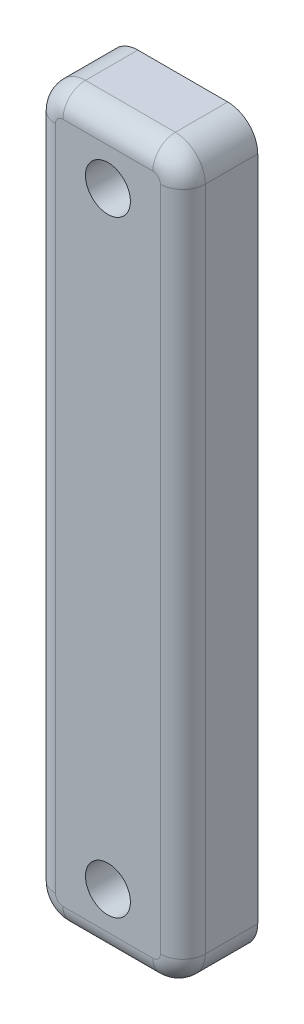
ISO-10303-21;
HEADER;
FILE_DESCRIPTION(('STEP AP214'),'2;1');
FILE_NAME('part.step','',(''),(''),'','','');
FILE_SCHEMA(('AUTOMOTIVE_DESIGN { 1 0 10303 214 1 1 1 1 }'));
ENDSEC;
DATA;
#1=APPLICATION_CONTEXT('core data for automotive mechanical design processes');
#2=APPLICATION_PROTOCOL_DEFINITION('international standard','automotive_design',2000,#1);
#3=PRODUCT_CONTEXT('',#1,'mechanical');
#4=PRODUCT('Part','Part','',(#3));
#5=PRODUCT_RELATED_PRODUCT_CATEGORY('part','',(#4));
#6=PRODUCT_DEFINITION_FORMATION('','',#4);
#7=PRODUCT_DEFINITION_CONTEXT('part definition',#1,'design');
#8=PRODUCT_DEFINITION('design','',#6,#7);
#9=PRODUCT_DEFINITION_SHAPE('','',#8);
#10=(LENGTH_UNIT() NAMED_UNIT(*) SI_UNIT(.MILLI.,.METRE.));
#11=(NAMED_UNIT(*) PLANE_ANGLE_UNIT() SI_UNIT($,.RADIAN.));
#12=(NAMED_UNIT(*) SI_UNIT($,.STERADIAN.) SOLID_ANGLE_UNIT());
#13=UNCERTAINTY_MEASURE_WITH_UNIT(LENGTH_MEASURE(1.E-05),#10,'distance_accuracy_value','');
#14=(GEOMETRIC_REPRESENTATION_CONTEXT(3) GLOBAL_UNCERTAINTY_ASSIGNED_CONTEXT((#13)) GLOBAL_UNIT_ASSIGNED_CONTEXT((#10,
#11,#12)) REPRESENTATION_CONTEXT('',''));
#15=CARTESIAN_POINT('',(0.,0.,0.));
#16=DIRECTION('',(0.,0.,1.));
#17=DIRECTION('',(1.,0.,0.));
#18=AXIS2_PLACEMENT_3D('',#15,#16,#17);
#19=CARTESIAN_POINT('',(8.,18.5841809112383,5.));
#20=DIRECTION('',(0.,0.,-1.));
#21=DIRECTION('',(-1.,0.,0.));
#22=AXIS2_PLACEMENT_3D('',#19,#20,#21);
#23=CYLINDRICAL_SURFACE('',#22,2.);
#24=DIRECTION('',(0.,0.,-1.));
#25=VECTOR('',#24,1.);
#26=CARTESIAN_POINT('',(7.99999999999998,20.5841809112383,5.));
#27=LINE('',#26,#25);
#28=CARTESIAN_POINT('',(7.99999999999998,20.5841809112383,3.5));
#29=VERTEX_POINT('',#28);
#30=CARTESIAN_POINT('',(7.99999999999998,20.5841809112383,0.));
#31=VERTEX_POINT('',#30);
#32=EDGE_CURVE('E120',#29,#31,#27,.T.);
#33=ORIENTED_EDGE('',*,*,#32,.F.);
#34=CARTESIAN_POINT('',(8.,18.5841809112383,3.5));
#35=DIRECTION('',(0.,0.,1.));
#36=DIRECTION('',(1.,0.,0.));
#37=AXIS2_PLACEMENT_3D('',#34,#35,#36);
#38=CIRCLE('',#37,2.);
#39=CARTESIAN_POINT('',(10.,18.5841809112383,3.5));
#40=VERTEX_POINT('',#39);
#41=EDGE_CURVE('E41',#29,#40,#38,.F.);
#42=ORIENTED_EDGE('',*,*,#41,.T.);
#43=DIRECTION('',(0.,0.,-1.));
#44=VECTOR('',#43,1.);
#45=CARTESIAN_POINT('',(10.,18.5841809112383,5.));
#46=LINE('',#45,#44);
#47=CARTESIAN_POINT('',(10.,18.5841809112383,0.));
#48=VERTEX_POINT('',#47);
#49=EDGE_CURVE('E139',#40,#48,#46,.T.);
#50=ORIENTED_EDGE('',*,*,#49,.T.);
#51=CARTESIAN_POINT('',(8.,18.5841809112383,0.));
#52=DIRECTION('',(0.,0.,1.));
#53=DIRECTION('',(1.,0.,0.));
#54=AXIS2_PLACEMENT_3D('',#51,#52,#53);
#55=CIRCLE('',#54,2.);
#56=EDGE_CURVE('E134',#48,#31,#55,.T.);
#57=ORIENTED_EDGE('',*,*,#56,.T.);
#58=EDGE_LOOP('',(#33,#42,#50,#57));
#59=FACE_BOUND('',#58,.T.);
#60=ADVANCED_FACE('F32',(#59),#23,.T.);
#61=CARTESIAN_POINT('',(7.99999999999998,20.5841809112383,5.));
#62=DIRECTION('',(0.,-1.,0.));
#63=DIRECTION('',(0.,0.,-1.));
#64=AXIS2_PLACEMENT_3D('',#61,#62,#63);
#65=PLANE('',#64);
#66=DIRECTION('',(0.,0.,-1.));
#67=VECTOR('',#66,1.);
#68=CARTESIAN_POINT('',(2.00000000000001,20.5841809112383,5.));
#69=LINE('',#68,#67);
#70=CARTESIAN_POINT('',(2.00000000000001,20.5841809112383,3.5));
#71=VERTEX_POINT('',#70);
#72=CARTESIAN_POINT('',(2.00000000000001,20.5841809112383,0.));
#73=VERTEX_POINT('',#72);
#74=EDGE_CURVE('E128',#71,#73,#69,.T.);
#75=ORIENTED_EDGE('',*,*,#74,.F.);
#76=DIRECTION('',(-1.,0.,0.));
#77=VECTOR('',#76,1.);
#78=CARTESIAN_POINT('',(7.99999999999998,20.5841809112383,3.5));
#79=LINE('',#78,#77);
#80=EDGE_CURVE('E56',#71,#29,#79,.F.);
#81=ORIENTED_EDGE('',*,*,#80,.T.);
#82=ORIENTED_EDGE('',*,*,#32,.T.);
#83=DIRECTION('',(-1.,0.,0.));
#84=VECTOR('',#83,1.);
#85=CARTESIAN_POINT('',(7.99999999999998,20.5841809112383,0.));
#86=LINE('',#85,#84);
#87=EDGE_CURVE('E123',#31,#73,#86,.T.);
#88=ORIENTED_EDGE('',*,*,#87,.T.);
#89=EDGE_LOOP('',(#75,#81,#82,#88));
#90=FACE_BOUND('',#89,.T.);
#91=ADVANCED_FACE('F122',(#90),#65,.F.);
#92=CARTESIAN_POINT('',(2.,18.5841809112383,5.));
#93=DIRECTION('',(0.,0.,-1.));
#94=DIRECTION('',(-1.,0.,0.));
#95=AXIS2_PLACEMENT_3D('',#92,#93,#94);
#96=CYLINDRICAL_SURFACE('',#95,2.);
#97=DIRECTION('',(0.,0.,-1.));
#98=VECTOR('',#97,1.);
#99=CARTESIAN_POINT('',(0.,18.5841809112383,5.));
#100=LINE('',#99,#98);
#101=CARTESIAN_POINT('',(0.,18.5841809112383,3.5));
#102=VERTEX_POINT('',#101);
#103=CARTESIAN_POINT('',(0.,18.5841809112383,0.));
#104=VERTEX_POINT('',#103);
#105=EDGE_CURVE('E174',#102,#104,#100,.T.);
#106=ORIENTED_EDGE('',*,*,#105,.F.);
#107=CARTESIAN_POINT('',(2.,18.5841809112383,3.5));
#108=DIRECTION('',(0.,0.,1.));
#109=DIRECTION('',(1.,0.,0.));
#110=AXIS2_PLACEMENT_3D('',#107,#108,#109);
#111=CIRCLE('',#110,2.);
#112=EDGE_CURVE('E202',#102,#71,#111,.F.);
#113=ORIENTED_EDGE('',*,*,#112,.T.);
#114=ORIENTED_EDGE('',*,*,#74,.T.);
#115=CARTESIAN_POINT('',(2.,18.5841809112383,0.));
#116=DIRECTION('',(0.,0.,1.));
#117=DIRECTION('',(1.,0.,0.));
#118=AXIS2_PLACEMENT_3D('',#115,#116,#117);
#119=CIRCLE('',#118,2.);
#120=EDGE_CURVE('E137',#73,#104,#119,.T.);
#121=ORIENTED_EDGE('',*,*,#120,.T.);
#122=EDGE_LOOP('',(#106,#113,#114,#121));
#123=FACE_BOUND('',#122,.T.);
#124=ADVANCED_FACE('F264',(#123),#96,.T.);
#125=CARTESIAN_POINT('',(0.,18.5841809112383,5.));
#126=DIRECTION('',(1.,0.,0.));
#127=DIRECTION('',(0.,1.,0.));
#128=AXIS2_PLACEMENT_3D('',#125,#126,#127);
#129=PLANE('',#128);
#130=DIRECTION('',(0.,0.,-1.));
#131=VECTOR('',#130,1.);
#132=CARTESIAN_POINT('',(0.,-25.9158190887617,5.));
#133=LINE('',#132,#131);
#134=CARTESIAN_POINT('',(0.,-25.9158190887617,3.5));
#135=VERTEX_POINT('',#134);
#136=CARTESIAN_POINT('',(0.,-25.9158190887617,0.));
#137=VERTEX_POINT('',#136);
#138=EDGE_CURVE('E172',#135,#137,#133,.T.);
#139=ORIENTED_EDGE('',*,*,#138,.F.);
#140=DIRECTION('',(0.,-1.,0.));
#141=VECTOR('',#140,1.);
#142=CARTESIAN_POINT('',(0.,18.5841809112383,3.5));
#143=LINE('',#142,#141);
#144=EDGE_CURVE('E200',#135,#102,#143,.F.);
#145=ORIENTED_EDGE('',*,*,#144,.T.);
#146=ORIENTED_EDGE('',*,*,#105,.T.);
#147=DIRECTION('',(0.,-1.,0.));
#148=VECTOR('',#147,1.);
#149=CARTESIAN_POINT('',(0.,18.5841809112383,0.));
#150=LINE('',#149,#148);
#151=EDGE_CURVE('E151',#104,#137,#150,.T.);
#152=ORIENTED_EDGE('',*,*,#151,.T.);
#153=EDGE_LOOP('',(#139,#145,#146,#152));
#154=FACE_BOUND('',#153,.T.);
#155=ADVANCED_FACE('F333',(#154),#129,.F.);
#156=CARTESIAN_POINT('',(1.99999999999993,-25.9158190887617,5.));
#157=DIRECTION('',(0.,0.,-1.));
#158=DIRECTION('',(-1.,0.,0.));
#159=AXIS2_PLACEMENT_3D('',#156,#157,#158);
#160=CYLINDRICAL_SURFACE('',#159,2.);
#161=DIRECTION('',(0.,0.,-1.));
#162=VECTOR('',#161,1.);
#163=CARTESIAN_POINT('',(1.99999999999994,-27.9158190887617,5.));
#164=LINE('',#163,#162);
#165=CARTESIAN_POINT('',(1.99999999999994,-27.9158190887617,3.5));
#166=VERTEX_POINT('',#165);
#167=CARTESIAN_POINT('',(1.99999999999994,-27.9158190887617,0.));
#168=VERTEX_POINT('',#167);
#169=EDGE_CURVE('E170',#166,#168,#164,.T.);
#170=ORIENTED_EDGE('',*,*,#169,.F.);
#171=CARTESIAN_POINT('',(1.99999999999993,-25.9158190887617,3.5));
#172=DIRECTION('',(0.,0.,1.));
#173=DIRECTION('',(1.,0.,0.));
#174=AXIS2_PLACEMENT_3D('',#171,#172,#173);
#175=CIRCLE('',#174,2.);
#176=EDGE_CURVE('E198',#166,#135,#175,.F.);
#177=ORIENTED_EDGE('',*,*,#176,.T.);
#178=ORIENTED_EDGE('',*,*,#138,.T.);
#179=CARTESIAN_POINT('',(1.99999999999993,-25.9158190887617,0.));
#180=DIRECTION('',(0.,0.,1.));
#181=DIRECTION('',(1.,0.,0.));
#182=AXIS2_PLACEMENT_3D('',#179,#180,#181);
#183=CIRCLE('',#182,2.);
#184=EDGE_CURVE('E154',#137,#168,#183,.T.);
#185=ORIENTED_EDGE('',*,*,#184,.T.);
#186=EDGE_LOOP('',(#170,#177,#178,#185));
#187=FACE_BOUND('',#186,.T.);
#188=ADVANCED_FACE('F325',(#187),#160,.T.);
#189=CARTESIAN_POINT('',(1.99999999999994,-27.9158190887617,5.));
#190=DIRECTION('',(0.,1.,0.));
#191=DIRECTION('',(-1.,0.,0.));
#192=AXIS2_PLACEMENT_3D('',#189,#190,#191);
#193=PLANE('',#192);
#194=DIRECTION('',(0.,0.,-1.));
#195=VECTOR('',#194,1.);
#196=CARTESIAN_POINT('',(7.99999999999991,-27.9158190887617,5.));
#197=LINE('',#196,#195);
#198=CARTESIAN_POINT('',(7.99999999999991,-27.9158190887617,3.5));
#199=VERTEX_POINT('',#198);
#200=CARTESIAN_POINT('',(7.99999999999991,-27.9158190887617,0.));
#201=VERTEX_POINT('',#200);
#202=EDGE_CURVE('E168',#199,#201,#197,.T.);
#203=ORIENTED_EDGE('',*,*,#202,.F.);
#204=DIRECTION('',(1.,0.,0.));
#205=VECTOR('',#204,1.);
#206=CARTESIAN_POINT('',(1.99999999999994,-27.9158190887617,3.5));
#207=LINE('',#206,#205);
#208=EDGE_CURVE('E196',#199,#166,#207,.F.);
#209=ORIENTED_EDGE('',*,*,#208,.T.);
#210=ORIENTED_EDGE('',*,*,#169,.T.);
#211=DIRECTION('',(1.,0.,0.));
#212=VECTOR('',#211,1.);
#213=CARTESIAN_POINT('',(1.99999999999994,-27.9158190887617,0.));
#214=LINE('',#213,#212);
#215=EDGE_CURVE('E157',#168,#201,#214,.T.);
#216=ORIENTED_EDGE('',*,*,#215,.T.);
#217=EDGE_LOOP('',(#203,#209,#210,#216));
#218=FACE_BOUND('',#217,.T.);
#219=ADVANCED_FACE('F322',(#218),#193,.F.);
#220=CARTESIAN_POINT('',(7.99999999999993,-25.9158190887617,5.));
#221=DIRECTION('',(0.,0.,-1.));
#222=DIRECTION('',(-1.,0.,0.));
#223=AXIS2_PLACEMENT_3D('',#220,#221,#222);
#224=CYLINDRICAL_SURFACE('',#223,2.);
#225=DIRECTION('',(0.,0.,-1.));
#226=VECTOR('',#225,1.);
#227=CARTESIAN_POINT('',(9.99999999999993,-25.9158190887617,5.));
#228=LINE('',#227,#226);
#229=CARTESIAN_POINT('',(9.99999999999993,-25.9158190887617,3.5));
#230=VERTEX_POINT('',#229);
#231=CARTESIAN_POINT('',(9.99999999999993,-25.9158190887617,0.));
#232=VERTEX_POINT('',#231);
#233=EDGE_CURVE('E166',#230,#232,#228,.T.);
#234=ORIENTED_EDGE('',*,*,#233,.F.);
#235=CARTESIAN_POINT('',(7.99999999999993,-25.9158190887617,3.5));
#236=DIRECTION('',(0.,0.,1.));
#237=DIRECTION('',(1.,0.,0.));
#238=AXIS2_PLACEMENT_3D('',#235,#236,#237);
#239=CIRCLE('',#238,2.);
#240=EDGE_CURVE('E193',#230,#199,#239,.F.);
#241=ORIENTED_EDGE('',*,*,#240,.T.);
#242=ORIENTED_EDGE('',*,*,#202,.T.);
#243=CARTESIAN_POINT('',(7.99999999999993,-25.9158190887617,0.));
#244=DIRECTION('',(0.,0.,1.));
#245=DIRECTION('',(1.,0.,0.));
#246=AXIS2_PLACEMENT_3D('',#243,#244,#245);
#247=CIRCLE('',#246,2.);
#248=EDGE_CURVE('E160',#201,#232,#247,.T.);
#249=ORIENTED_EDGE('',*,*,#248,.T.);
#250=EDGE_LOOP('',(#234,#241,#242,#249));
#251=FACE_BOUND('',#250,.T.);
#252=ADVANCED_FACE('F312',(#251),#224,.T.);
#253=CARTESIAN_POINT('',(9.99999999999993,-25.9158190887617,5.));
#254=DIRECTION('',(-1.,0.,0.));
#255=DIRECTION('',(0.,-1.,0.));
#256=AXIS2_PLACEMENT_3D('',#253,#254,#255);
#257=PLANE('',#256);
#258=ORIENTED_EDGE('',*,*,#49,.F.);
#259=DIRECTION('',(0.,1.,0.));
#260=VECTOR('',#259,1.);
#261=CARTESIAN_POINT('',(9.99999999999993,-25.9158190887617,3.5));
#262=LINE('',#261,#260);
#263=EDGE_CURVE('E11',#40,#230,#262,.F.);
#264=ORIENTED_EDGE('',*,*,#263,.T.);
#265=ORIENTED_EDGE('',*,*,#233,.T.);
#266=DIRECTION('',(0.,1.,0.));
#267=VECTOR('',#266,1.);
#268=CARTESIAN_POINT('',(9.99999999999993,-25.9158190887617,0.));
#269=LINE('',#268,#267);
#270=EDGE_CURVE('E163',#232,#48,#269,.T.);
#271=ORIENTED_EDGE('',*,*,#270,.T.);
#272=EDGE_LOOP('',(#258,#264,#265,#271));
#273=FACE_BOUND('',#272,.T.);
#274=ADVANCED_FACE('F255',(#273),#257,.F.);
#275=CARTESIAN_POINT('',(8.,18.5841809112383,5.));
#276=DIRECTION('',(0.,0.,1.));
#277=DIRECTION('',(1.,0.,0.));
#278=AXIS2_PLACEMENT_3D('',#275,#276,#277);
#279=PLANE('',#278);
#280=DIRECTION('',(1.,0.,0.));
#281=VECTOR('',#280,1.);
#282=CARTESIAN_POINT('',(7.99999999999991,-26.4158190887617,5.));
#283=LINE('',#282,#281);
#284=CARTESIAN_POINT('',(1.99999999999994,-26.4158190887617,5.));
#285=VERTEX_POINT('',#284);
#286=CARTESIAN_POINT('',(7.99999999999992,-26.4158190887617,5.));
#287=VERTEX_POINT('',#286);
#288=EDGE_CURVE('E188',#285,#287,#283,.T.);
#289=ORIENTED_EDGE('',*,*,#288,.T.);
#290=CARTESIAN_POINT('',(7.99999999999993,-25.9158190887617,5.));
#291=DIRECTION('',(0.,0.,1.));
#292=DIRECTION('',(1.,0.,0.));
#293=AXIS2_PLACEMENT_3D('',#290,#291,#292);
#294=CIRCLE('',#293,0.499999999999999);
#295=CARTESIAN_POINT('',(8.49999999999993,-25.9158190887617,5.));
#296=VERTEX_POINT('',#295);
#297=EDGE_CURVE('E190',#287,#296,#294,.T.);
#298=ORIENTED_EDGE('',*,*,#297,.T.);
#299=DIRECTION('',(0.,1.,0.));
#300=VECTOR('',#299,1.);
#301=CARTESIAN_POINT('',(8.5,18.5841809112383,5.));
#302=LINE('',#301,#300);
#303=CARTESIAN_POINT('',(8.5,18.5841809112383,5.));
#304=VERTEX_POINT('',#303);
#305=EDGE_CURVE('E127',#296,#304,#302,.T.);
#306=ORIENTED_EDGE('',*,*,#305,.T.);
#307=CARTESIAN_POINT('',(8.,18.5841809112383,5.));
#308=DIRECTION('',(0.,0.,1.));
#309=DIRECTION('',(1.,0.,0.));
#310=AXIS2_PLACEMENT_3D('',#307,#308,#309);
#311=CIRCLE('',#310,0.499999999999999);
#312=CARTESIAN_POINT('',(7.99999999999998,19.0841809112383,5.));
#313=VERTEX_POINT('',#312);
#314=EDGE_CURVE('E178',#304,#313,#311,.T.);
#315=ORIENTED_EDGE('',*,*,#314,.T.);
#316=DIRECTION('',(-1.,0.,0.));
#317=VECTOR('',#316,1.);
#318=CARTESIAN_POINT('',(2.00000000000001,19.0841809112383,5.));
#319=LINE('',#318,#317);
#320=CARTESIAN_POINT('',(2.,19.0841809112383,5.));
#321=VERTEX_POINT('',#320);
#322=EDGE_CURVE('E180',#313,#321,#319,.T.);
#323=ORIENTED_EDGE('',*,*,#322,.T.);
#324=CARTESIAN_POINT('',(2.,18.5841809112383,5.));
#325=DIRECTION('',(0.,0.,1.));
#326=DIRECTION('',(1.,0.,0.));
#327=AXIS2_PLACEMENT_3D('',#324,#325,#326);
#328=CIRCLE('',#327,0.499999999999998);
#329=CARTESIAN_POINT('',(1.5,18.5841809112383,5.));
#330=VERTEX_POINT('',#329);
#331=EDGE_CURVE('E182',#321,#330,#328,.T.);
#332=ORIENTED_EDGE('',*,*,#331,.T.);
#333=DIRECTION('',(0.,-1.,0.));
#334=VECTOR('',#333,1.);
#335=CARTESIAN_POINT('',(1.49999999999993,-25.9158190887617,5.));
#336=LINE('',#335,#334);
#337=CARTESIAN_POINT('',(1.49999999999993,-25.9158190887617,5.));
#338=VERTEX_POINT('',#337);
#339=EDGE_CURVE('E184',#330,#338,#336,.T.);
#340=ORIENTED_EDGE('',*,*,#339,.T.);
#341=CARTESIAN_POINT('',(1.99999999999993,-25.9158190887617,5.));
#342=DIRECTION('',(0.,0.,1.));
#343=DIRECTION('',(1.,0.,0.));
#344=AXIS2_PLACEMENT_3D('',#341,#342,#343);
#345=CIRCLE('',#344,0.499999999999999);
#346=EDGE_CURVE('E186',#338,#285,#345,.T.);
#347=ORIENTED_EDGE('',*,*,#346,.T.);
#348=EDGE_LOOP('',(#289,#298,#306,#315,#323,#332,#340,#347));
#349=FACE_BOUND('',#348,.T.);
#350=CARTESIAN_POINT('',(4.99999999999992,-23.9158190887617,5.));
#351=DIRECTION('',(0.,0.,-1.));
#352=DIRECTION('',(-1.,0.,0.));
#353=AXIS2_PLACEMENT_3D('',#350,#351,#352);
#354=CIRCLE('',#353,1.5);
#355=CARTESIAN_POINT('',(3.49999999999992,-23.9158190887617,5.));
#356=VERTEX_POINT('',#355);
#357=EDGE_CURVE('E141',#356,#356,#354,.T.);
#358=ORIENTED_EDGE('',*,*,#357,.T.);
#359=EDGE_LOOP('',(#358));
#360=FACE_BOUND('',#359,.T.);
#361=CARTESIAN_POINT('',(4.99999999999996,16.5841809112383,5.));
#362=DIRECTION('',(0.,0.,-1.));
#363=DIRECTION('',(-1.,0.,0.));
#364=AXIS2_PLACEMENT_3D('',#361,#362,#363);
#365=CIRCLE('',#364,1.5);
#366=CARTESIAN_POINT('',(3.49999999999996,16.5841809112383,5.));
#367=VERTEX_POINT('',#366);
#368=EDGE_CURVE('E232',#367,#367,#365,.T.);
#369=ORIENTED_EDGE('',*,*,#368,.T.);
#370=EDGE_LOOP('',(#369));
#371=FACE_BOUND('',#370,.T.);
#372=ADVANCED_FACE('F247',(#349,#360,#371),#279,.T.);
#373=CARTESIAN_POINT('',(8.,18.5841809112383,0.));
#374=DIRECTION('',(0.,0.,1.));
#375=DIRECTION('',(1.,0.,0.));
#376=AXIS2_PLACEMENT_3D('',#373,#374,#375);
#377=PLANE('',#376);
#378=CARTESIAN_POINT('',(4.99999999999992,-23.9158190887617,0.));
#379=DIRECTION('',(0.,0.,-1.));
#380=DIRECTION('',(-1.,0.,0.));
#381=AXIS2_PLACEMENT_3D('',#378,#379,#380);
#382=CIRCLE('',#381,1.5);
#383=CARTESIAN_POINT('',(3.49999999999992,-23.9158190887617,0.));
#384=VERTEX_POINT('',#383);
#385=EDGE_CURVE('E144',#384,#384,#382,.T.);
#386=ORIENTED_EDGE('',*,*,#385,.F.);
#387=EDGE_LOOP('',(#386));
#388=FACE_BOUND('',#387,.T.);
#389=CARTESIAN_POINT('',(4.99999999999996,16.5841809112383,0.));
#390=DIRECTION('',(0.,0.,-1.));
#391=DIRECTION('',(-1.,0.,0.));
#392=AXIS2_PLACEMENT_3D('',#389,#390,#391);
#393=CIRCLE('',#392,1.5);
#394=CARTESIAN_POINT('',(3.49999999999996,16.5841809112383,0.));
#395=VERTEX_POINT('',#394);
#396=EDGE_CURVE('E147',#395,#395,#393,.T.);
#397=ORIENTED_EDGE('',*,*,#396,.F.);
#398=EDGE_LOOP('',(#397));
#399=FACE_BOUND('',#398,.T.);
#400=ORIENTED_EDGE('',*,*,#56,.F.);
#401=ORIENTED_EDGE('',*,*,#270,.F.);
#402=ORIENTED_EDGE('',*,*,#248,.F.);
#403=ORIENTED_EDGE('',*,*,#215,.F.);
#404=ORIENTED_EDGE('',*,*,#184,.F.);
#405=ORIENTED_EDGE('',*,*,#151,.F.);
#406=ORIENTED_EDGE('',*,*,#120,.F.);
#407=ORIENTED_EDGE('',*,*,#87,.F.);
#408=EDGE_LOOP('',(#400,#401,#402,#403,#404,#405,#406,#407));
#409=FACE_BOUND('',#408,.T.);
#410=ADVANCED_FACE('F132',(#388,#399,#409),#377,.F.);
#411=CARTESIAN_POINT('',(4.99999999999996,16.5841809112383,5.));
#412=DIRECTION('',(0.,0.,-1.));
#413=DIRECTION('',(-1.,0.,0.));
#414=AXIS2_PLACEMENT_3D('',#411,#412,#413);
#415=CYLINDRICAL_SURFACE('',#414,1.5);
#416=ORIENTED_EDGE('',*,*,#368,.F.);
#417=EDGE_LOOP('',(#416));
#418=FACE_BOUND('',#417,.T.);
#419=ORIENTED_EDGE('',*,*,#396,.T.);
#420=EDGE_LOOP('',(#419));
#421=FACE_BOUND('',#420,.T.);
#422=ADVANCED_FACE('F246',(#418,#421),#415,.F.);
#423=CARTESIAN_POINT('',(4.99999999999992,-23.9158190887617,5.));
#424=DIRECTION('',(0.,0.,-1.));
#425=DIRECTION('',(-1.,0.,0.));
#426=AXIS2_PLACEMENT_3D('',#423,#424,#425);
#427=CYLINDRICAL_SURFACE('',#426,1.5);
#428=ORIENTED_EDGE('',*,*,#357,.F.);
#429=EDGE_LOOP('',(#428));
#430=FACE_BOUND('',#429,.T.);
#431=ORIENTED_EDGE('',*,*,#385,.T.);
#432=EDGE_LOOP('',(#431));
#433=FACE_BOUND('',#432,.T.);
#434=ADVANCED_FACE('F242',(#430,#433),#427,.F.);
#435=CARTESIAN_POINT('',(2.,18.5841809112383,3.5));
#436=DIRECTION('',(0.,0.,1.));
#437=DIRECTION('',(1.,0.,0.));
#438=AXIS2_PLACEMENT_3D('',#435,#436,#437);
#439=DEGENERATE_TOROIDAL_SURFACE('',#438,0.499999999999998,1.5,.T.);
#440=CARTESIAN_POINT('',(2.,19.0841809112383,3.5));
#441=DIRECTION('',(1.,0.,0.));
#442=DIRECTION('',(0.,1.,0.));
#443=AXIS2_PLACEMENT_3D('',#440,#441,#442);
#444=CIRCLE('',#443,1.5);
#445=EDGE_CURVE('E221',#71,#321,#444,.T.);
#446=ORIENTED_EDGE('',*,*,#445,.F.);
#447=ORIENTED_EDGE('',*,*,#112,.F.);
#448=CARTESIAN_POINT('',(1.5,18.5841809112383,3.5));
#449=DIRECTION('',(0.,-1.,0.));
#450=DIRECTION('',(1.,0.,0.));
#451=AXIS2_PLACEMENT_3D('',#448,#449,#450);
#452=CIRCLE('',#451,1.5);
#453=EDGE_CURVE('E36',#330,#102,#452,.T.);
#454=ORIENTED_EDGE('',*,*,#453,.F.);
#455=ORIENTED_EDGE('',*,*,#331,.F.);
#456=EDGE_LOOP('',(#446,#447,#454,#455));
#457=FACE_BOUND('',#456,.T.);
#458=ADVANCED_FACE('F34',(#457),#439,.T.);
#459=CARTESIAN_POINT('',(1.5,18.5841809112383,3.5));
#460=DIRECTION('',(0.,1.,0.));
#461=DIRECTION('',(-1.,0.,0.));
#462=AXIS2_PLACEMENT_3D('',#459,#460,#461);
#463=CYLINDRICAL_SURFACE('',#462,1.5);
#464=ORIENTED_EDGE('',*,*,#453,.T.);
#465=ORIENTED_EDGE('',*,*,#144,.F.);
#466=CARTESIAN_POINT('',(1.49999999999993,-25.9158190887617,3.5));
#467=DIRECTION('',(0.,-1.,0.));
#468=DIRECTION('',(0.,0.,-1.));
#469=AXIS2_PLACEMENT_3D('',#466,#467,#468);
#470=CIRCLE('',#469,1.5);
#471=EDGE_CURVE('E219',#338,#135,#470,.T.);
#472=ORIENTED_EDGE('',*,*,#471,.F.);
#473=ORIENTED_EDGE('',*,*,#339,.F.);
#474=EDGE_LOOP('',(#464,#465,#472,#473));
#475=FACE_BOUND('',#474,.T.);
#476=ADVANCED_FACE('F290',(#475),#463,.T.);
#477=CARTESIAN_POINT('',(8.,19.0841809112383,3.5));
#478=DIRECTION('',(1.,0.,0.));
#479=DIRECTION('',(0.,0.,-1.));
#480=AXIS2_PLACEMENT_3D('',#477,#478,#479);
#481=CYLINDRICAL_SURFACE('',#480,1.5);
#482=ORIENTED_EDGE('',*,*,#445,.T.);
#483=ORIENTED_EDGE('',*,*,#322,.F.);
#484=CARTESIAN_POINT('',(7.99999999999998,19.0841809112383,3.5));
#485=DIRECTION('',(1.,0.,0.));
#486=DIRECTION('',(0.,0.,-1.));
#487=AXIS2_PLACEMENT_3D('',#484,#485,#486);
#488=CIRCLE('',#487,1.5);
#489=EDGE_CURVE('E216',#29,#313,#488,.T.);
#490=ORIENTED_EDGE('',*,*,#489,.F.);
#491=ORIENTED_EDGE('',*,*,#80,.F.);
#492=EDGE_LOOP('',(#482,#483,#490,#491));
#493=FACE_BOUND('',#492,.T.);
#494=ADVANCED_FACE('F287',(#493),#481,.T.);
#495=CARTESIAN_POINT('',(1.99999999999993,-25.9158190887617,3.5));
#496=DIRECTION('',(0.,0.,1.));
#497=DIRECTION('',(1.,0.,0.));
#498=AXIS2_PLACEMENT_3D('',#495,#496,#497);
#499=DEGENERATE_TOROIDAL_SURFACE('',#498,0.499999999999999,1.5,.T.);
#500=ORIENTED_EDGE('',*,*,#471,.T.);
#501=ORIENTED_EDGE('',*,*,#176,.F.);
#502=CARTESIAN_POINT('',(1.99999999999994,-26.4158190887617,3.5));
#503=DIRECTION('',(1.,0.,0.));
#504=DIRECTION('',(0.,1.,0.));
#505=AXIS2_PLACEMENT_3D('',#502,#503,#504);
#506=CIRCLE('',#505,1.5);
#507=EDGE_CURVE('E213',#285,#166,#506,.T.);
#508=ORIENTED_EDGE('',*,*,#507,.F.);
#509=ORIENTED_EDGE('',*,*,#346,.F.);
#510=EDGE_LOOP('',(#500,#501,#508,#509));
#511=FACE_BOUND('',#510,.T.);
#512=ADVANCED_FACE('F283',(#511),#499,.T.);
#513=CARTESIAN_POINT('',(8.,18.5841809112383,3.5));
#514=DIRECTION('',(0.,0.,1.));
#515=DIRECTION('',(1.,0.,0.));
#516=AXIS2_PLACEMENT_3D('',#513,#514,#515);
#517=DEGENERATE_TOROIDAL_SURFACE('',#516,0.499999999999999,1.5,.T.);
#518=ORIENTED_EDGE('',*,*,#489,.T.);
#519=ORIENTED_EDGE('',*,*,#314,.F.);
#520=CARTESIAN_POINT('',(8.5,18.5841809112383,3.5));
#521=DIRECTION('',(0.,-1.,0.));
#522=DIRECTION('',(1.,0.,0.));
#523=AXIS2_PLACEMENT_3D('',#520,#521,#522);
#524=CIRCLE('',#523,1.5);
#525=EDGE_CURVE('E210',#40,#304,#524,.T.);
#526=ORIENTED_EDGE('',*,*,#525,.F.);
#527=ORIENTED_EDGE('',*,*,#41,.F.);
#528=EDGE_LOOP('',(#518,#519,#526,#527));
#529=FACE_BOUND('',#528,.T.);
#530=ADVANCED_FACE('F279',(#529),#517,.T.);
#531=CARTESIAN_POINT('',(7.99999999999984,-26.4158190887617,3.5));
#532=DIRECTION('',(-1.,0.,0.));
#533=DIRECTION('',(0.,-1.,0.));
#534=AXIS2_PLACEMENT_3D('',#531,#532,#533);
#535=CYLINDRICAL_SURFACE('',#534,1.5);
#536=ORIENTED_EDGE('',*,*,#507,.T.);
#537=ORIENTED_EDGE('',*,*,#208,.F.);
#538=CARTESIAN_POINT('',(7.99999999999992,-26.4158190887617,3.5));
#539=DIRECTION('',(1.,0.,0.));
#540=DIRECTION('',(0.,1.,0.));
#541=AXIS2_PLACEMENT_3D('',#538,#539,#540);
#542=CIRCLE('',#541,1.5);
#543=EDGE_CURVE('E208',#287,#199,#542,.T.);
#544=ORIENTED_EDGE('',*,*,#543,.F.);
#545=ORIENTED_EDGE('',*,*,#288,.F.);
#546=EDGE_LOOP('',(#536,#537,#544,#545));
#547=FACE_BOUND('',#546,.T.);
#548=ADVANCED_FACE('F275',(#547),#535,.T.);
#549=CARTESIAN_POINT('',(8.5,18.5841809112383,3.5));
#550=DIRECTION('',(0.,-1.,0.));
#551=DIRECTION('',(1.,0.,0.));
#552=AXIS2_PLACEMENT_3D('',#549,#550,#551);
#553=CYLINDRICAL_SURFACE('',#552,1.5);
#554=ORIENTED_EDGE('',*,*,#525,.T.);
#555=ORIENTED_EDGE('',*,*,#305,.F.);
#556=CARTESIAN_POINT('',(8.49999999999993,-25.9158190887617,3.5));
#557=DIRECTION('',(0.,-1.,0.));
#558=DIRECTION('',(0.,0.,-1.));
#559=AXIS2_PLACEMENT_3D('',#556,#557,#558);
#560=CIRCLE('',#559,1.5);
#561=EDGE_CURVE('E206',#230,#296,#560,.T.);
#562=ORIENTED_EDGE('',*,*,#561,.F.);
#563=ORIENTED_EDGE('',*,*,#263,.F.);
#564=EDGE_LOOP('',(#554,#555,#562,#563));
#565=FACE_BOUND('',#564,.T.);
#566=ADVANCED_FACE('F271',(#565),#553,.T.);
#567=CARTESIAN_POINT('',(7.99999999999993,-25.9158190887617,3.5));
#568=DIRECTION('',(0.,0.,1.));
#569=DIRECTION('',(1.,0.,0.));
#570=AXIS2_PLACEMENT_3D('',#567,#568,#569);
#571=DEGENERATE_TOROIDAL_SURFACE('',#570,0.499999999999999,1.5,.T.);
#572=ORIENTED_EDGE('',*,*,#543,.T.);
#573=ORIENTED_EDGE('',*,*,#240,.F.);
#574=ORIENTED_EDGE('',*,*,#561,.T.);
#575=ORIENTED_EDGE('',*,*,#297,.F.);
#576=EDGE_LOOP('',(#572,#573,#574,#575));
#577=FACE_BOUND('',#576,.T.);
#578=ADVANCED_FACE('F268',(#577),#571,.T.);
#579=CLOSED_SHELL('',(#60,#91,#124,#155,#188,#219,#252,#274,#372,#410,#422,#434,#458,#476,#494,
#512,#530,#548,#566,#578));
#580=MANIFOLD_SOLID_BREP('B2',#579);
#581=ADVANCED_BREP_SHAPE_REPRESENTATION('',(#18,#580),#14);
#582=SHAPE_DEFINITION_REPRESENTATION(#9,#581);
ENDSEC;
END-ISO-10303-21;
